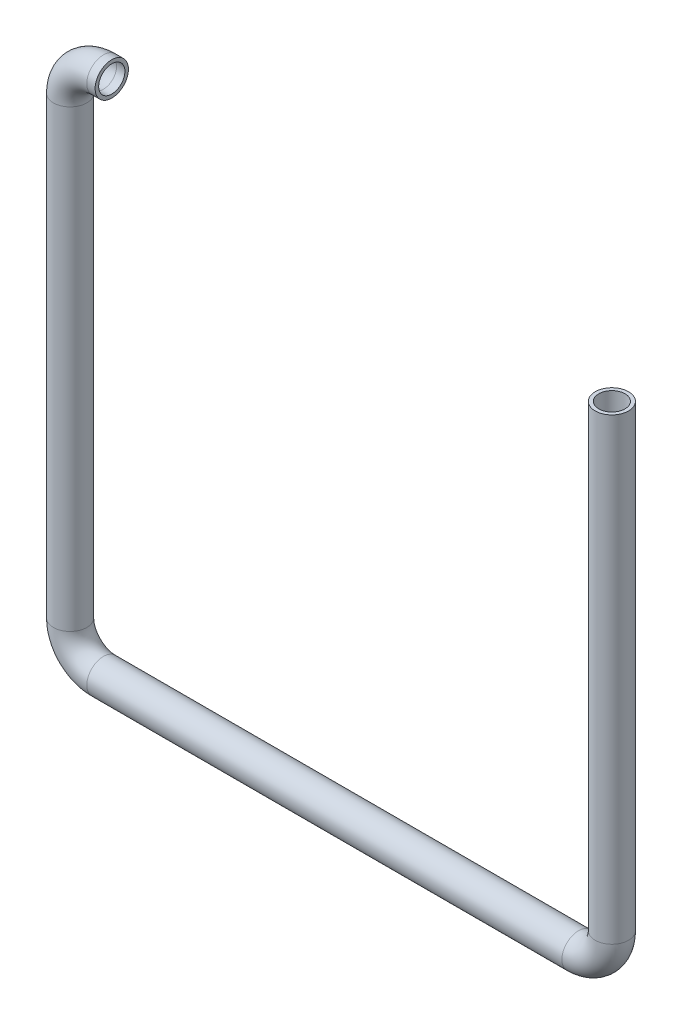
ISO-10303-21;
HEADER;
FILE_DESCRIPTION(('STEP AP214'),'2;1');
FILE_NAME('part.step','',(''),(''),'','','');
FILE_SCHEMA(('AUTOMOTIVE_DESIGN { 1 0 10303 214 1 1 1 1 }'));
ENDSEC;
DATA;
#1=APPLICATION_CONTEXT('core data for automotive mechanical design processes');
#2=APPLICATION_PROTOCOL_DEFINITION('international standard','automotive_design',2000,#1);
#3=PRODUCT_CONTEXT('',#1,'mechanical');
#4=PRODUCT('Part','Part','',(#3));
#5=PRODUCT_RELATED_PRODUCT_CATEGORY('part','',(#4));
#6=PRODUCT_DEFINITION_FORMATION('','',#4);
#7=PRODUCT_DEFINITION_CONTEXT('part definition',#1,'design');
#8=PRODUCT_DEFINITION('design','',#6,#7);
#9=PRODUCT_DEFINITION_SHAPE('','',#8);
#10=(LENGTH_UNIT() NAMED_UNIT(*) SI_UNIT(.MILLI.,.METRE.));
#11=(NAMED_UNIT(*) PLANE_ANGLE_UNIT() SI_UNIT($,.RADIAN.));
#12=(NAMED_UNIT(*) SI_UNIT($,.STERADIAN.) SOLID_ANGLE_UNIT());
#13=UNCERTAINTY_MEASURE_WITH_UNIT(LENGTH_MEASURE(1.E-05),#10,'distance_accuracy_value','');
#14=(GEOMETRIC_REPRESENTATION_CONTEXT(3) GLOBAL_UNCERTAINTY_ASSIGNED_CONTEXT((#13)) GLOBAL_UNIT_ASSIGNED_CONTEXT((#10,
#11,#12)) REPRESENTATION_CONTEXT('',''));
#15=CARTESIAN_POINT('',(0.,0.,0.));
#16=DIRECTION('',(0.,0.,1.));
#17=DIRECTION('',(1.,0.,0.));
#18=AXIS2_PLACEMENT_3D('',#15,#16,#17);
#19=CARTESIAN_POINT('',(0.,0.,0.));
#20=DIRECTION('',(-1.,0.,0.));
#21=DIRECTION('',(0.,0.,1.));
#22=AXIS2_PLACEMENT_3D('',#19,#20,#21);
#23=CYLINDRICAL_SURFACE('',#22,4.);
#24=CARTESIAN_POINT('',(-1.99999999999994,0.,0.));
#25=DIRECTION('',(1.,0.,0.));
#26=DIRECTION('',(0.,0.,-1.));
#27=AXIS2_PLACEMENT_3D('',#24,#25,#26);
#28=CIRCLE('',#27,4.);
#29=CARTESIAN_POINT('',(-1.99999999999991,4.,0.));
#30=VERTEX_POINT('',#29);
#31=EDGE_CURVE('E58',#30,#30,#28,.T.);
#32=ORIENTED_EDGE('',*,*,#31,.T.);
#33=EDGE_LOOP('',(#32));
#34=FACE_BOUND('',#33,.T.);
#35=CARTESIAN_POINT('',(0.,0.,0.));
#36=DIRECTION('',(1.,0.,0.));
#37=DIRECTION('',(0.,0.,-1.));
#38=AXIS2_PLACEMENT_3D('',#35,#36,#37);
#39=CIRCLE('',#38,4.);
#40=CARTESIAN_POINT('',(0.,0.,-4.));
#41=VERTEX_POINT('',#40);
#42=EDGE_CURVE('E55',#41,#41,#39,.T.);
#43=ORIENTED_EDGE('',*,*,#42,.F.);
#44=EDGE_LOOP('',(#43));
#45=FACE_BOUND('',#44,.T.);
#46=ADVANCED_FACE('F34',(#34,#45),#23,.T.);
#47=CARTESIAN_POINT('',(-2.,-8.,0.));
#48=DIRECTION('',(0.,0.,1.));
#49=DIRECTION('',(1.,0.,0.));
#50=AXIS2_PLACEMENT_3D('',#47,#48,#49);
#51=TOROIDAL_SURFACE('',#50,8.,4.);
#52=CARTESIAN_POINT('',(-10.,-8.00000000000005,0.));
#53=DIRECTION('',(0.,1.,0.));
#54=DIRECTION('',(0.,0.,-1.));
#55=AXIS2_PLACEMENT_3D('',#52,#53,#54);
#56=CIRCLE('',#55,4.);
#57=CARTESIAN_POINT('',(-14.,-8.00000000000008,0.));
#58=VERTEX_POINT('',#57);
#59=EDGE_CURVE('E61',#58,#58,#56,.T.);
#60=CARTESIAN_POINT('',(-2.,-8.,0.));
#61=DIRECTION('',(0.,0.,1.));
#62=DIRECTION('',(1.,0.,0.));
#63=AXIS2_PLACEMENT_3D('',#60,#61,#62);
#64=CIRCLE('',#63,12.);
#65=EDGE_CURVE('',#30,#58,#64,.T.);
#66=ORIENTED_EDGE('',*,*,#31,.F.);
#67=ORIENTED_EDGE('',*,*,#59,.T.);
#68=ORIENTED_EDGE('',*,*,#65,.T.);
#69=ORIENTED_EDGE('',*,*,#65,.F.);
#70=EDGE_LOOP('',(#66,#68,#67,#69));
#71=FACE_BOUND('',#70,.T.);
#72=ADVANCED_FACE('F109',(#71),#51,.T.);
#73=CARTESIAN_POINT('',(-10.,-8.00000000000005,0.));
#74=DIRECTION('',(0.,-1.,0.));
#75=DIRECTION('',(1.,0.,0.));
#76=AXIS2_PLACEMENT_3D('',#73,#74,#75);
#77=CYLINDRICAL_SURFACE('',#76,4.);
#78=CARTESIAN_POINT('',(-9.99999999999999,-117.,0.));
#79=DIRECTION('',(0.,1.,0.));
#80=DIRECTION('',(0.,0.,-1.));
#81=AXIS2_PLACEMENT_3D('',#78,#79,#80);
#82=CIRCLE('',#81,4.);
#83=CARTESIAN_POINT('',(-14.,-117.,0.));
#84=VERTEX_POINT('',#83);
#85=EDGE_CURVE('E64',#84,#84,#82,.T.);
#86=ORIENTED_EDGE('',*,*,#85,.T.);
#87=EDGE_LOOP('',(#86));
#88=FACE_BOUND('',#87,.T.);
#89=ORIENTED_EDGE('',*,*,#59,.F.);
#90=EDGE_LOOP('',(#89));
#91=FACE_BOUND('',#90,.T.);
#92=ADVANCED_FACE('F113',(#88,#91),#77,.T.);
#93=CARTESIAN_POINT('',(-1.99999999999998,-117.,0.));
#94=DIRECTION('',(0.,0.,1.));
#95=DIRECTION('',(1.,0.,0.));
#96=AXIS2_PLACEMENT_3D('',#93,#94,#95);
#97=TOROIDAL_SURFACE('',#96,8.,4.);
#98=CARTESIAN_POINT('',(-1.99999999999999,-125.,0.));
#99=DIRECTION('',(-1.,0.,0.));
#100=DIRECTION('',(0.,0.,-1.));
#101=AXIS2_PLACEMENT_3D('',#98,#99,#100);
#102=CIRCLE('',#101,4.);
#103=CARTESIAN_POINT('',(-1.99999999999999,-129.,0.));
#104=VERTEX_POINT('',#103);
#105=EDGE_CURVE('E67',#104,#104,#102,.T.);
#106=CARTESIAN_POINT('',(-1.99999999999998,-117.,0.));
#107=DIRECTION('',(0.,0.,1.));
#108=DIRECTION('',(1.,0.,0.));
#109=AXIS2_PLACEMENT_3D('',#106,#107,#108);
#110=CIRCLE('',#109,12.);
#111=EDGE_CURVE('',#84,#104,#110,.T.);
#112=ORIENTED_EDGE('',*,*,#85,.F.);
#113=ORIENTED_EDGE('',*,*,#105,.T.);
#114=ORIENTED_EDGE('',*,*,#111,.T.);
#115=ORIENTED_EDGE('',*,*,#111,.F.);
#116=EDGE_LOOP('',(#112,#114,#113,#115));
#117=FACE_BOUND('',#116,.T.);
#118=ADVANCED_FACE('F117',(#117),#97,.T.);
#119=CARTESIAN_POINT('',(-1.99999999999999,-125.,0.));
#120=DIRECTION('',(1.,0.,0.));
#121=DIRECTION('',(0.,0.,-1.));
#122=AXIS2_PLACEMENT_3D('',#119,#120,#121);
#123=CYLINDRICAL_SURFACE('',#122,4.);
#124=CARTESIAN_POINT('',(112.,-125.,0.));
#125=DIRECTION('',(-1.,0.,0.));
#126=DIRECTION('',(0.,0.,-1.));
#127=AXIS2_PLACEMENT_3D('',#124,#125,#126);
#128=CIRCLE('',#127,4.);
#129=CARTESIAN_POINT('',(112.,-129.,0.));
#130=VERTEX_POINT('',#129);
#131=EDGE_CURVE('E69',#130,#130,#128,.T.);
#132=ORIENTED_EDGE('',*,*,#131,.T.);
#133=EDGE_LOOP('',(#132));
#134=FACE_BOUND('',#133,.T.);
#135=ORIENTED_EDGE('',*,*,#105,.F.);
#136=EDGE_LOOP('',(#135));
#137=FACE_BOUND('',#136,.T.);
#138=ADVANCED_FACE('F89',(#134,#137),#123,.T.);
#139=CARTESIAN_POINT('',(112.,-117.,0.));
#140=DIRECTION('',(0.,0.,1.));
#141=DIRECTION('',(1.,0.,0.));
#142=AXIS2_PLACEMENT_3D('',#139,#140,#141);
#143=TOROIDAL_SURFACE('',#142,8.00000000000001,4.);
#144=CARTESIAN_POINT('',(120.,-117.,0.));
#145=DIRECTION('',(0.,-1.,0.));
#146=DIRECTION('',(0.,0.,-1.));
#147=AXIS2_PLACEMENT_3D('',#144,#145,#146);
#148=CIRCLE('',#147,4.);
#149=CARTESIAN_POINT('',(124.,-117.,0.));
#150=VERTEX_POINT('',#149);
#151=EDGE_CURVE('E38',#150,#150,#148,.T.);
#152=CARTESIAN_POINT('',(112.,-117.,0.));
#153=DIRECTION('',(0.,0.,1.));
#154=DIRECTION('',(1.,0.,0.));
#155=AXIS2_PLACEMENT_3D('',#152,#153,#154);
#156=CIRCLE('',#155,12.);
#157=EDGE_CURVE('',#130,#150,#156,.T.);
#158=ORIENTED_EDGE('',*,*,#131,.F.);
#159=ORIENTED_EDGE('',*,*,#151,.T.);
#160=ORIENTED_EDGE('',*,*,#157,.T.);
#161=ORIENTED_EDGE('',*,*,#157,.F.);
#162=EDGE_LOOP('',(#158,#160,#159,#161));
#163=FACE_BOUND('',#162,.T.);
#164=ADVANCED_FACE('F76',(#163),#143,.T.);
#165=CARTESIAN_POINT('',(120.,-117.,0.));
#166=DIRECTION('',(0.,1.,0.));
#167=DIRECTION('',(0.,0.,1.));
#168=AXIS2_PLACEMENT_3D('',#165,#166,#167);
#169=CYLINDRICAL_SURFACE('',#168,4.);
#170=CARTESIAN_POINT('',(120.,-6.99999999999996,0.));
#171=DIRECTION('',(0.,-1.,0.));
#172=DIRECTION('',(0.,0.,-1.));
#173=AXIS2_PLACEMENT_3D('',#170,#171,#172);
#174=CIRCLE('',#173,4.);
#175=CARTESIAN_POINT('',(120.,-6.99999999999996,-4.));
#176=VERTEX_POINT('',#175);
#177=EDGE_CURVE('E51',#176,#176,#174,.T.);
#178=ORIENTED_EDGE('',*,*,#177,.T.);
#179=EDGE_LOOP('',(#178));
#180=FACE_BOUND('',#179,.T.);
#181=ORIENTED_EDGE('',*,*,#151,.F.);
#182=EDGE_LOOP('',(#181));
#183=FACE_BOUND('',#182,.T.);
#184=ADVANCED_FACE('F36',(#180,#183),#169,.T.);
#185=CARTESIAN_POINT('',(0.,0.,0.));
#186=DIRECTION('',(1.,0.,0.));
#187=DIRECTION('',(0.,0.,-1.));
#188=AXIS2_PLACEMENT_3D('',#185,#186,#187);
#189=PLANE('',#188);
#190=CARTESIAN_POINT('',(0.,0.,0.));
#191=DIRECTION('',(1.,0.,0.));
#192=DIRECTION('',(0.,0.,-1.));
#193=AXIS2_PLACEMENT_3D('',#190,#191,#192);
#194=CIRCLE('',#193,3.15);
#195=CARTESIAN_POINT('',(0.,0.,-3.15));
#196=VERTEX_POINT('',#195);
#197=EDGE_CURVE('E54',#196,#196,#194,.F.);
#198=ORIENTED_EDGE('',*,*,#197,.T.);
#199=EDGE_LOOP('',(#198));
#200=FACE_BOUND('',#199,.T.);
#201=ORIENTED_EDGE('',*,*,#42,.T.);
#202=EDGE_LOOP('',(#201));
#203=FACE_BOUND('',#202,.T.);
#204=ADVANCED_FACE('F80',(#200,#203),#189,.T.);
#205=CARTESIAN_POINT('',(120.,-6.99999999999996,0.));
#206=DIRECTION('',(0.,-1.,0.));
#207=DIRECTION('',(0.,0.,-1.));
#208=AXIS2_PLACEMENT_3D('',#205,#206,#207);
#209=PLANE('',#208);
#210=CARTESIAN_POINT('',(120.,-6.99999999999996,0.));
#211=DIRECTION('',(0.,-1.,0.));
#212=DIRECTION('',(0.,0.,-1.));
#213=AXIS2_PLACEMENT_3D('',#210,#211,#212);
#214=CIRCLE('',#213,3.15);
#215=CARTESIAN_POINT('',(120.,-6.99999999999996,-3.15));
#216=VERTEX_POINT('',#215);
#217=EDGE_CURVE('E10',#216,#216,#214,.F.);
#218=ORIENTED_EDGE('',*,*,#217,.F.);
#219=EDGE_LOOP('',(#218));
#220=FACE_BOUND('',#219,.T.);
#221=ORIENTED_EDGE('',*,*,#177,.F.);
#222=EDGE_LOOP('',(#221));
#223=FACE_BOUND('',#222,.T.);
#224=ADVANCED_FACE('F86',(#220,#223),#209,.F.);
#225=CARTESIAN_POINT('',(0.,0.,0.));
#226=DIRECTION('',(-1.,0.,0.));
#227=DIRECTION('',(0.,0.,1.));
#228=AXIS2_PLACEMENT_3D('',#225,#226,#227);
#229=CYLINDRICAL_SURFACE('',#228,3.15);
#230=CARTESIAN_POINT('',(-1.99999999999994,0.,0.));
#231=DIRECTION('',(1.,0.,0.));
#232=DIRECTION('',(0.,0.,-1.));
#233=AXIS2_PLACEMENT_3D('',#230,#231,#232);
#234=CIRCLE('',#233,3.15);
#235=CARTESIAN_POINT('',(-1.99999999999992,3.15,0.));
#236=VERTEX_POINT('',#235);
#237=EDGE_CURVE('E233',#236,#236,#234,.F.);
#238=ORIENTED_EDGE('',*,*,#237,.T.);
#239=EDGE_LOOP('',(#238));
#240=FACE_BOUND('',#239,.T.);
#241=ORIENTED_EDGE('',*,*,#197,.F.);
#242=EDGE_LOOP('',(#241));
#243=FACE_BOUND('',#242,.T.);
#244=ADVANCED_FACE('F104',(#240,#243),#229,.F.);
#245=CARTESIAN_POINT('',(-2.,-8.,0.));
#246=DIRECTION('',(0.,0.,1.));
#247=DIRECTION('',(1.,0.,0.));
#248=AXIS2_PLACEMENT_3D('',#245,#246,#247);
#249=TOROIDAL_SURFACE('',#248,8.,3.15);
#250=CARTESIAN_POINT('',(-10.,-8.00000000000005,0.));
#251=DIRECTION('',(0.,1.,0.));
#252=DIRECTION('',(0.,0.,-1.));
#253=AXIS2_PLACEMENT_3D('',#250,#251,#252);
#254=CIRCLE('',#253,3.15);
#255=CARTESIAN_POINT('',(-13.15,-8.00000000000007,0.));
#256=VERTEX_POINT('',#255);
#257=EDGE_CURVE('E228',#256,#256,#254,.F.);
#258=CARTESIAN_POINT('',(-2.,-8.,0.));
#259=DIRECTION('',(0.,0.,1.));
#260=DIRECTION('',(1.,0.,0.));
#261=AXIS2_PLACEMENT_3D('',#258,#259,#260);
#262=CIRCLE('',#261,11.15);
#263=EDGE_CURVE('',#236,#256,#262,.T.);
#264=ORIENTED_EDGE('',*,*,#237,.F.);
#265=ORIENTED_EDGE('',*,*,#257,.T.);
#266=ORIENTED_EDGE('',*,*,#263,.T.);
#267=ORIENTED_EDGE('',*,*,#263,.F.);
#268=EDGE_LOOP('',(#264,#266,#265,#267));
#269=FACE_BOUND('',#268,.T.);
#270=ADVANCED_FACE('F167',(#269),#249,.F.);
#271=CARTESIAN_POINT('',(-10.,-8.00000000000005,0.));
#272=DIRECTION('',(0.,-1.,0.));
#273=DIRECTION('',(1.,0.,0.));
#274=AXIS2_PLACEMENT_3D('',#271,#272,#273);
#275=CYLINDRICAL_SURFACE('',#274,3.15);
#276=CARTESIAN_POINT('',(-9.99999999999999,-117.,0.));
#277=DIRECTION('',(0.,1.,0.));
#278=DIRECTION('',(0.,0.,-1.));
#279=AXIS2_PLACEMENT_3D('',#276,#277,#278);
#280=CIRCLE('',#279,3.15);
#281=CARTESIAN_POINT('',(-13.15,-117.,0.));
#282=VERTEX_POINT('',#281);
#283=EDGE_CURVE('E225',#282,#282,#280,.F.);
#284=ORIENTED_EDGE('',*,*,#283,.T.);
#285=EDGE_LOOP('',(#284));
#286=FACE_BOUND('',#285,.T.);
#287=ORIENTED_EDGE('',*,*,#257,.F.);
#288=EDGE_LOOP('',(#287));
#289=FACE_BOUND('',#288,.T.);
#290=ADVANCED_FACE('F177',(#286,#289),#275,.F.);
#291=CARTESIAN_POINT('',(-1.99999999999998,-117.,0.));
#292=DIRECTION('',(0.,0.,1.));
#293=DIRECTION('',(1.,0.,0.));
#294=AXIS2_PLACEMENT_3D('',#291,#292,#293);
#295=TOROIDAL_SURFACE('',#294,8.,3.15);
#296=CARTESIAN_POINT('',(-1.99999999999999,-125.,0.));
#297=DIRECTION('',(-1.,0.,0.));
#298=DIRECTION('',(0.,0.,-1.));
#299=AXIS2_PLACEMENT_3D('',#296,#297,#298);
#300=CIRCLE('',#299,3.15);
#301=CARTESIAN_POINT('',(-1.99999999999999,-128.15,0.));
#302=VERTEX_POINT('',#301);
#303=EDGE_CURVE('E224',#302,#302,#300,.F.);
#304=CARTESIAN_POINT('',(-1.99999999999998,-117.,0.));
#305=DIRECTION('',(0.,0.,1.));
#306=DIRECTION('',(1.,0.,0.));
#307=AXIS2_PLACEMENT_3D('',#304,#305,#306);
#308=CIRCLE('',#307,11.15);
#309=EDGE_CURVE('',#282,#302,#308,.T.);
#310=ORIENTED_EDGE('',*,*,#283,.F.);
#311=ORIENTED_EDGE('',*,*,#303,.T.);
#312=ORIENTED_EDGE('',*,*,#309,.T.);
#313=ORIENTED_EDGE('',*,*,#309,.F.);
#314=EDGE_LOOP('',(#310,#312,#311,#313));
#315=FACE_BOUND('',#314,.T.);
#316=ADVANCED_FACE('F187',(#315),#295,.F.);
#317=CARTESIAN_POINT('',(-1.99999999999999,-125.,0.));
#318=DIRECTION('',(1.,0.,0.));
#319=DIRECTION('',(0.,0.,-1.));
#320=AXIS2_PLACEMENT_3D('',#317,#318,#319);
#321=CYLINDRICAL_SURFACE('',#320,3.15);
#322=CARTESIAN_POINT('',(112.,-125.,0.));
#323=DIRECTION('',(-1.,0.,0.));
#324=DIRECTION('',(0.,0.,-1.));
#325=AXIS2_PLACEMENT_3D('',#322,#323,#324);
#326=CIRCLE('',#325,3.15);
#327=CARTESIAN_POINT('',(112.,-128.15,0.));
#328=VERTEX_POINT('',#327);
#329=EDGE_CURVE('E47',#328,#328,#326,.F.);
#330=ORIENTED_EDGE('',*,*,#329,.T.);
#331=EDGE_LOOP('',(#330));
#332=FACE_BOUND('',#331,.T.);
#333=ORIENTED_EDGE('',*,*,#303,.F.);
#334=EDGE_LOOP('',(#333));
#335=FACE_BOUND('',#334,.T.);
#336=ADVANCED_FACE('F97',(#332,#335),#321,.F.);
#337=CARTESIAN_POINT('',(112.,-117.,0.));
#338=DIRECTION('',(0.,0.,1.));
#339=DIRECTION('',(1.,0.,0.));
#340=AXIS2_PLACEMENT_3D('',#337,#338,#339);
#341=TOROIDAL_SURFACE('',#340,8.00000000000001,3.15);
#342=CARTESIAN_POINT('',(120.,-117.,0.));
#343=DIRECTION('',(0.,-1.,0.));
#344=DIRECTION('',(0.,0.,-1.));
#345=AXIS2_PLACEMENT_3D('',#342,#343,#344);
#346=CIRCLE('',#345,3.15);
#347=CARTESIAN_POINT('',(123.15,-117.,0.));
#348=VERTEX_POINT('',#347);
#349=EDGE_CURVE('E42',#348,#348,#346,.F.);
#350=CARTESIAN_POINT('',(112.,-117.,0.));
#351=DIRECTION('',(0.,0.,1.));
#352=DIRECTION('',(1.,0.,0.));
#353=AXIS2_PLACEMENT_3D('',#350,#351,#352);
#354=CIRCLE('',#353,11.15);
#355=EDGE_CURVE('',#328,#348,#354,.T.);
#356=ORIENTED_EDGE('',*,*,#329,.F.);
#357=ORIENTED_EDGE('',*,*,#349,.T.);
#358=ORIENTED_EDGE('',*,*,#355,.T.);
#359=ORIENTED_EDGE('',*,*,#355,.F.);
#360=EDGE_LOOP('',(#356,#358,#357,#359));
#361=FACE_BOUND('',#360,.T.);
#362=ADVANCED_FACE('F92',(#361),#341,.F.);
#363=CARTESIAN_POINT('',(120.,-117.,0.));
#364=DIRECTION('',(0.,1.,0.));
#365=DIRECTION('',(0.,0.,1.));
#366=AXIS2_PLACEMENT_3D('',#363,#364,#365);
#367=CYLINDRICAL_SURFACE('',#366,3.15);
#368=ORIENTED_EDGE('',*,*,#217,.T.);
#369=EDGE_LOOP('',(#368));
#370=FACE_BOUND('',#369,.T.);
#371=ORIENTED_EDGE('',*,*,#349,.F.);
#372=EDGE_LOOP('',(#371));
#373=FACE_BOUND('',#372,.T.);
#374=ADVANCED_FACE('F90',(#370,#373),#367,.F.);
#375=CLOSED_SHELL('',(#46,#72,#92,#118,#138,#164,#184,#204,#224,#244,#270,#290,#316,#336,#362,#374));
#376=MANIFOLD_SOLID_BREP('B2',#375);
#377=ADVANCED_BREP_SHAPE_REPRESENTATION('',(#18,#376),#14);
#378=SHAPE_DEFINITION_REPRESENTATION(#9,#377);
ENDSEC;
END-ISO-10303-21;
